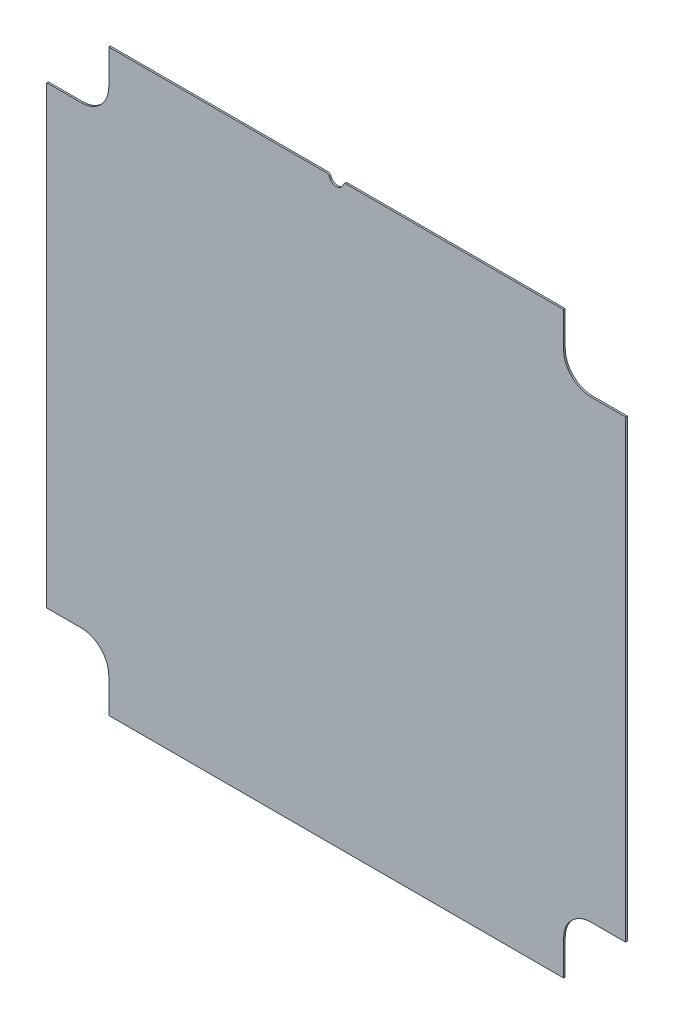
ISO-10303-21;
HEADER;
FILE_DESCRIPTION(('STEP AP214'),'2;1');
FILE_NAME('part.step','',(''),(''),'','','');
FILE_SCHEMA(('AUTOMOTIVE_DESIGN { 1 0 10303 214 1 1 1 1 }'));
ENDSEC;
DATA;
#1=APPLICATION_CONTEXT('core data for automotive mechanical design processes');
#2=APPLICATION_PROTOCOL_DEFINITION('international standard','automotive_design',2000,#1);
#3=PRODUCT_CONTEXT('',#1,'mechanical');
#4=PRODUCT('Part','Part','',(#3));
#5=PRODUCT_RELATED_PRODUCT_CATEGORY('part','',(#4));
#6=PRODUCT_DEFINITION_FORMATION('','',#4);
#7=PRODUCT_DEFINITION_CONTEXT('part definition',#1,'design');
#8=PRODUCT_DEFINITION('design','',#6,#7);
#9=PRODUCT_DEFINITION_SHAPE('','',#8);
#10=(LENGTH_UNIT() NAMED_UNIT(*) SI_UNIT(.MILLI.,.METRE.));
#11=(NAMED_UNIT(*) PLANE_ANGLE_UNIT() SI_UNIT($,.RADIAN.));
#12=(NAMED_UNIT(*) SI_UNIT($,.STERADIAN.) SOLID_ANGLE_UNIT());
#13=UNCERTAINTY_MEASURE_WITH_UNIT(LENGTH_MEASURE(1.E-05),#10,'distance_accuracy_value','');
#14=(GEOMETRIC_REPRESENTATION_CONTEXT(3) GLOBAL_UNCERTAINTY_ASSIGNED_CONTEXT((#13)) GLOBAL_UNIT_ASSIGNED_CONTEXT((#10,
#11,#12)) REPRESENTATION_CONTEXT('',''));
#15=CARTESIAN_POINT('',(0.,0.,0.));
#16=DIRECTION('',(0.,0.,1.));
#17=DIRECTION('',(1.,0.,0.));
#18=AXIS2_PLACEMENT_3D('',#15,#16,#17);
#19=CARTESIAN_POINT('',(-133.35,133.35,6.35));
#20=DIRECTION('',(0.,-1.,0.));
#21=DIRECTION('',(0.,0.,-1.));
#22=AXIS2_PLACEMENT_3D('',#19,#20,#21);
#23=PLANE('',#22);
#24=DIRECTION('',(-1.,0.,0.));
#25=VECTOR('',#24,1.);
#26=CARTESIAN_POINT('',(-133.35,133.35,6.35));
#27=LINE('',#26,#25);
#28=CARTESIAN_POINT('',(104.775,133.35,6.35));
#29=VERTEX_POINT('',#28);
#30=CARTESIAN_POINT('',(4.6246139298324,133.35,6.35));
#31=VERTEX_POINT('',#30);
#32=EDGE_CURVE('E222',#29,#31,#27,.T.);
#33=ORIENTED_EDGE('',*,*,#32,.F.);
#34=DIRECTION('',(0.,0.,1.));
#35=VECTOR('',#34,1.);
#36=CARTESIAN_POINT('',(104.775,133.35,5.58799999999997));
#37=LINE('',#36,#35);
#38=CARTESIAN_POINT('',(104.775,133.35,5.58799999999997));
#39=VERTEX_POINT('',#38);
#40=EDGE_CURVE('E266',#39,#29,#37,.T.);
#41=ORIENTED_EDGE('',*,*,#40,.F.);
#42=DIRECTION('',(1.,0.,0.));
#43=VECTOR('',#42,1.);
#44=CARTESIAN_POINT('',(-133.35,133.35,5.588));
#45=LINE('',#44,#43);
#46=CARTESIAN_POINT('',(4.6246139298324,133.35,5.588));
#47=VERTEX_POINT('',#46);
#48=EDGE_CURVE('E206',#47,#39,#45,.T.);
#49=ORIENTED_EDGE('',*,*,#48,.F.);
#50=DIRECTION('',(0.,0.,1.));
#51=VECTOR('',#50,1.);
#52=CARTESIAN_POINT('',(4.6246139298324,133.35,6.35));
#53=LINE('',#52,#51);
#54=EDGE_CURVE('E228',#47,#31,#53,.T.);
#55=ORIENTED_EDGE('',*,*,#54,.T.);
#56=EDGE_LOOP('',(#33,#41,#49,#55));
#57=FACE_BOUND('',#56,.T.);
#58=ADVANCED_FACE('F39',(#57),#23,.F.);
#59=CARTESIAN_POINT('',(0.,0.,6.35));
#60=DIRECTION('',(0.,0.,-1.));
#61=DIRECTION('',(-1.,0.,0.));
#62=AXIS2_PLACEMENT_3D('',#59,#60,#61);
#63=PLANE('',#62);
#64=DIRECTION('',(0.,1.,0.));
#65=VECTOR('',#64,1.);
#66=CARTESIAN_POINT('',(133.35,-133.35,6.35));
#67=LINE('',#66,#65);
#68=CARTESIAN_POINT('',(133.35,-104.775,6.35));
#69=VERTEX_POINT('',#68);
#70=CARTESIAN_POINT('',(133.35,104.775,6.35));
#71=VERTEX_POINT('',#70);
#72=EDGE_CURVE('E218',#69,#71,#67,.T.);
#73=ORIENTED_EDGE('',*,*,#72,.T.);
#74=DIRECTION('',(1.,0.,0.));
#75=VECTOR('',#74,1.);
#76=CARTESIAN_POINT('',(133.35,104.775,6.35));
#77=LINE('',#76,#75);
#78=CARTESIAN_POINT('',(117.475,104.775,6.35));
#79=VERTEX_POINT('',#78);
#80=EDGE_CURVE('E335',#79,#71,#77,.T.);
#81=ORIENTED_EDGE('',*,*,#80,.F.);
#82=CARTESIAN_POINT('',(117.475,117.475,6.35));
#83=DIRECTION('',(0.,0.,1.));
#84=DIRECTION('',(-1.,0.,0.));
#85=AXIS2_PLACEMENT_3D('',#82,#83,#84);
#86=CIRCLE('',#85,12.7);
#87=CARTESIAN_POINT('',(104.775,117.475,6.35));
#88=VERTEX_POINT('',#87);
#89=EDGE_CURVE('E339',#88,#79,#86,.T.);
#90=ORIENTED_EDGE('',*,*,#89,.F.);
#91=DIRECTION('',(0.,-1.,0.));
#92=VECTOR('',#91,1.);
#93=CARTESIAN_POINT('',(104.775,117.475,6.35));
#94=LINE('',#93,#92);
#95=EDGE_CURVE('E337',#29,#88,#94,.T.);
#96=ORIENTED_EDGE('',*,*,#95,.F.);
#97=ORIENTED_EDGE('',*,*,#32,.T.);
#98=CARTESIAN_POINT('',(4.62461392983241,131.7625,6.35));
#99=DIRECTION('',(0.,0.,-1.));
#100=DIRECTION('',(-1.,0.,0.));
#101=AXIS2_PLACEMENT_3D('',#98,#99,#100);
#102=CIRCLE('',#101,1.5875);
#103=CARTESIAN_POINT('',(3.12311590066604,132.277922077922,6.35));
#104=VERTEX_POINT('',#103);
#105=EDGE_CURVE('E233',#31,#104,#102,.F.);
#106=ORIENTED_EDGE('',*,*,#105,.T.);
#107=CARTESIAN_POINT('',(0.,133.35,6.35));
#108=DIRECTION('',(0.,0.,1.));
#109=DIRECTION('',(1.,0.,0.));
#110=AXIS2_PLACEMENT_3D('',#107,#108,#109);
#111=CIRCLE('',#110,3.302);
#112=CARTESIAN_POINT('',(-3.12311590066604,132.277922077922,6.35));
#113=VERTEX_POINT('',#112);
#114=EDGE_CURVE('E215',#113,#104,#111,.T.);
#115=ORIENTED_EDGE('',*,*,#114,.F.);
#116=CARTESIAN_POINT('',(-4.62461392983241,131.7625,6.35));
#117=DIRECTION('',(0.,0.,-1.));
#118=DIRECTION('',(-1.,0.,0.));
#119=AXIS2_PLACEMENT_3D('',#116,#117,#118);
#120=CIRCLE('',#119,1.5875);
#121=CARTESIAN_POINT('',(-4.6246139298324,133.35,6.35));
#122=VERTEX_POINT('',#121);
#123=EDGE_CURVE('E231',#113,#122,#120,.F.);
#124=ORIENTED_EDGE('',*,*,#123,.T.);
#125=CARTESIAN_POINT('',(-104.775,133.35,6.35));
#126=VERTEX_POINT('',#125);
#127=EDGE_CURVE('E221',#122,#126,#27,.T.);
#128=ORIENTED_EDGE('',*,*,#127,.T.);
#129=DIRECTION('',(0.,1.,0.));
#130=VECTOR('',#129,1.);
#131=CARTESIAN_POINT('',(-104.775,117.475,6.35));
#132=LINE('',#131,#130);
#133=CARTESIAN_POINT('',(-104.775,117.475,6.35));
#134=VERTEX_POINT('',#133);
#135=EDGE_CURVE('E283',#134,#126,#132,.T.);
#136=ORIENTED_EDGE('',*,*,#135,.F.);
#137=CARTESIAN_POINT('',(-117.475,117.475,6.35));
#138=DIRECTION('',(0.,0.,1.));
#139=DIRECTION('',(1.,0.,0.));
#140=AXIS2_PLACEMENT_3D('',#137,#138,#139);
#141=CIRCLE('',#140,12.7);
#142=CARTESIAN_POINT('',(-117.475,104.775,6.35));
#143=VERTEX_POINT('',#142);
#144=EDGE_CURVE('E292',#143,#134,#141,.T.);
#145=ORIENTED_EDGE('',*,*,#144,.F.);
#146=DIRECTION('',(1.,0.,0.));
#147=VECTOR('',#146,1.);
#148=CARTESIAN_POINT('',(-133.35,104.775,6.35));
#149=LINE('',#148,#147);
#150=CARTESIAN_POINT('',(-133.35,104.775,6.35));
#151=VERTEX_POINT('',#150);
#152=EDGE_CURVE('E289',#151,#143,#149,.T.);
#153=ORIENTED_EDGE('',*,*,#152,.F.);
#154=DIRECTION('',(0.,-1.,0.));
#155=VECTOR('',#154,1.);
#156=CARTESIAN_POINT('',(-133.35,-133.35,6.35));
#157=LINE('',#156,#155);
#158=CARTESIAN_POINT('',(-133.35,-104.775,6.35));
#159=VERTEX_POINT('',#158);
#160=EDGE_CURVE('E224',#151,#159,#157,.T.);
#161=ORIENTED_EDGE('',*,*,#160,.T.);
#162=DIRECTION('',(-1.,0.,0.));
#163=VECTOR('',#162,1.);
#164=CARTESIAN_POINT('',(-133.35,-104.775,6.35));
#165=LINE('',#164,#163);
#166=CARTESIAN_POINT('',(-117.475,-104.775,6.35));
#167=VERTEX_POINT('',#166);
#168=EDGE_CURVE('E183',#167,#159,#165,.T.);
#169=ORIENTED_EDGE('',*,*,#168,.F.);
#170=CARTESIAN_POINT('',(-117.475,-117.475,6.35));
#171=DIRECTION('',(0.,0.,1.));
#172=DIRECTION('',(-1.,0.,0.));
#173=AXIS2_PLACEMENT_3D('',#170,#171,#172);
#174=CIRCLE('',#173,12.7);
#175=CARTESIAN_POINT('',(-104.775,-117.475,6.35));
#176=VERTEX_POINT('',#175);
#177=EDGE_CURVE('E368',#176,#167,#174,.T.);
#178=ORIENTED_EDGE('',*,*,#177,.F.);
#179=DIRECTION('',(0.,1.,0.));
#180=VECTOR('',#179,1.);
#181=CARTESIAN_POINT('',(-104.775,-117.475,6.35));
#182=LINE('',#181,#180);
#183=CARTESIAN_POINT('',(-104.775,-133.35,6.35));
#184=VERTEX_POINT('',#183);
#185=EDGE_CURVE('E326',#184,#176,#182,.T.);
#186=ORIENTED_EDGE('',*,*,#185,.F.);
#187=DIRECTION('',(1.,0.,0.));
#188=VECTOR('',#187,1.);
#189=CARTESIAN_POINT('',(-133.35,-133.35,6.35));
#190=LINE('',#189,#188);
#191=CARTESIAN_POINT('',(104.775,-133.35,6.35));
#192=VERTEX_POINT('',#191);
#193=EDGE_CURVE('E192',#184,#192,#190,.T.);
#194=ORIENTED_EDGE('',*,*,#193,.T.);
#195=DIRECTION('',(0.,-1.,0.));
#196=VECTOR('',#195,1.);
#197=CARTESIAN_POINT('',(104.775,-117.475,6.35));
#198=LINE('',#197,#196);
#199=CARTESIAN_POINT('',(104.775,-117.475,6.35));
#200=VERTEX_POINT('',#199);
#201=EDGE_CURVE('E356',#200,#192,#198,.T.);
#202=ORIENTED_EDGE('',*,*,#201,.F.);
#203=CARTESIAN_POINT('',(117.475,-117.475,6.35));
#204=DIRECTION('',(0.,0.,1.));
#205=DIRECTION('',(1.,0.,0.));
#206=AXIS2_PLACEMENT_3D('',#203,#204,#205);
#207=CIRCLE('',#206,12.7);
#208=CARTESIAN_POINT('',(117.475,-104.775,6.35));
#209=VERTEX_POINT('',#208);
#210=EDGE_CURVE('E343',#209,#200,#207,.T.);
#211=ORIENTED_EDGE('',*,*,#210,.F.);
#212=DIRECTION('',(-1.,0.,0.));
#213=VECTOR('',#212,1.);
#214=CARTESIAN_POINT('',(133.35,-104.775,6.35));
#215=LINE('',#214,#213);
#216=EDGE_CURVE('E352',#69,#209,#215,.T.);
#217=ORIENTED_EDGE('',*,*,#216,.F.);
#218=EDGE_LOOP('',(#73,#81,#90,#96,#97,#106,#115,#124,#128,#136,#145,#153,#161,#169,#178,#186,
#194,#202,#211,#217));
#219=FACE_BOUND('',#218,.T.);
#220=ADVANCED_FACE('F350',(#219),#63,.F.);
#221=CARTESIAN_POINT('',(133.35,-133.35,6.35));
#222=DIRECTION('',(-1.,0.,0.));
#223=DIRECTION('',(0.,0.,1.));
#224=AXIS2_PLACEMENT_3D('',#221,#222,#223);
#225=PLANE('',#224);
#226=DIRECTION('',(0.,-1.,0.));
#227=VECTOR('',#226,1.);
#228=CARTESIAN_POINT('',(133.35,133.35,5.588));
#229=LINE('',#228,#227);
#230=CARTESIAN_POINT('',(133.35,104.775,5.58799999999997));
#231=VERTEX_POINT('',#230);
#232=CARTESIAN_POINT('',(133.35,-104.775,5.58799999999997));
#233=VERTEX_POINT('',#232);
#234=EDGE_CURVE('E209',#231,#233,#229,.T.);
#235=ORIENTED_EDGE('',*,*,#234,.F.);
#236=DIRECTION('',(0.,0.,1.));
#237=VECTOR('',#236,1.);
#238=CARTESIAN_POINT('',(133.35,104.775,5.58799999999997));
#239=LINE('',#238,#237);
#240=EDGE_CURVE('E318',#231,#71,#239,.T.);
#241=ORIENTED_EDGE('',*,*,#240,.T.);
#242=ORIENTED_EDGE('',*,*,#72,.F.);
#243=DIRECTION('',(0.,0.,1.));
#244=VECTOR('',#243,1.);
#245=CARTESIAN_POINT('',(133.35,-104.775,5.58799999999997));
#246=LINE('',#245,#244);
#247=EDGE_CURVE('E319',#233,#69,#246,.T.);
#248=ORIENTED_EDGE('',*,*,#247,.F.);
#249=EDGE_LOOP('',(#235,#241,#242,#248));
#250=FACE_BOUND('',#249,.T.);
#251=ADVANCED_FACE('F316',(#250),#225,.F.);
#252=CARTESIAN_POINT('',(-104.775,133.35,5.58799999999997));
#253=VERTEX_POINT('',#252);
#254=CARTESIAN_POINT('',(-4.6246139298324,133.35,5.588));
#255=VERTEX_POINT('',#254);
#256=EDGE_CURVE('E201',#253,#255,#45,.T.);
#257=ORIENTED_EDGE('',*,*,#256,.F.);
#258=DIRECTION('',(0.,0.,1.));
#259=VECTOR('',#258,1.);
#260=CARTESIAN_POINT('',(-104.775,133.35,5.58799999999997));
#261=LINE('',#260,#259);
#262=EDGE_CURVE('E297',#253,#126,#261,.T.);
#263=ORIENTED_EDGE('',*,*,#262,.T.);
#264=ORIENTED_EDGE('',*,*,#127,.F.);
#265=DIRECTION('',(0.,0.,1.));
#266=VECTOR('',#265,1.);
#267=CARTESIAN_POINT('',(-4.6246139298324,133.35,6.35));
#268=LINE('',#267,#266);
#269=EDGE_CURVE('E47',#122,#255,#268,.F.);
#270=ORIENTED_EDGE('',*,*,#269,.T.);
#271=EDGE_LOOP('',(#257,#263,#264,#270));
#272=FACE_BOUND('',#271,.T.);
#273=ADVANCED_FACE('F244',(#272),#23,.F.);
#274=CARTESIAN_POINT('',(-133.35,-133.35,6.35));
#275=DIRECTION('',(1.,0.,0.));
#276=DIRECTION('',(0.,0.,-1.));
#277=AXIS2_PLACEMENT_3D('',#274,#275,#276);
#278=PLANE('',#277);
#279=DIRECTION('',(0.,-1.,0.));
#280=VECTOR('',#279,1.);
#281=CARTESIAN_POINT('',(-133.35,133.35,5.588));
#282=LINE('',#281,#280);
#283=CARTESIAN_POINT('',(-133.35,104.775,5.58799999999997));
#284=VERTEX_POINT('',#283);
#285=CARTESIAN_POINT('',(-133.35,-104.775,5.58799999999997));
#286=VERTEX_POINT('',#285);
#287=EDGE_CURVE('E212',#284,#286,#282,.T.);
#288=ORIENTED_EDGE('',*,*,#287,.T.);
#289=DIRECTION('',(0.,0.,1.));
#290=VECTOR('',#289,1.);
#291=CARTESIAN_POINT('',(-133.35,-104.775,5.58799999999997));
#292=LINE('',#291,#290);
#293=EDGE_CURVE('E293',#286,#159,#292,.T.);
#294=ORIENTED_EDGE('',*,*,#293,.T.);
#295=ORIENTED_EDGE('',*,*,#160,.F.);
#296=DIRECTION('',(0.,0.,1.));
#297=VECTOR('',#296,1.);
#298=CARTESIAN_POINT('',(-133.35,104.775,5.58799999999997));
#299=LINE('',#298,#297);
#300=EDGE_CURVE('E288',#284,#151,#299,.T.);
#301=ORIENTED_EDGE('',*,*,#300,.F.);
#302=EDGE_LOOP('',(#288,#294,#295,#301));
#303=FACE_BOUND('',#302,.T.);
#304=ADVANCED_FACE('F379',(#303),#278,.F.);
#305=CARTESIAN_POINT('',(-133.35,-133.35,6.35));
#306=DIRECTION('',(0.,1.,0.));
#307=DIRECTION('',(0.,0.,1.));
#308=AXIS2_PLACEMENT_3D('',#305,#306,#307);
#309=PLANE('',#308);
#310=DIRECTION('',(1.,0.,0.));
#311=VECTOR('',#310,1.);
#312=CARTESIAN_POINT('',(-133.35,-133.35,5.58799999999997));
#313=LINE('',#312,#311);
#314=CARTESIAN_POINT('',(-104.775,-133.35,5.58799999999997));
#315=VERTEX_POINT('',#314);
#316=CARTESIAN_POINT('',(104.775,-133.35,5.58799999999997));
#317=VERTEX_POINT('',#316);
#318=EDGE_CURVE('E190',#315,#317,#313,.T.);
#319=ORIENTED_EDGE('',*,*,#318,.T.);
#320=DIRECTION('',(0.,0.,1.));
#321=VECTOR('',#320,1.);
#322=CARTESIAN_POINT('',(104.775,-133.35,5.58799999999997));
#323=LINE('',#322,#321);
#324=EDGE_CURVE('E324',#317,#192,#323,.T.);
#325=ORIENTED_EDGE('',*,*,#324,.T.);
#326=ORIENTED_EDGE('',*,*,#193,.F.);
#327=DIRECTION('',(0.,0.,1.));
#328=VECTOR('',#327,1.);
#329=CARTESIAN_POINT('',(-104.775,-133.35,5.58799999999997));
#330=LINE('',#329,#328);
#331=EDGE_CURVE('E178',#315,#184,#330,.T.);
#332=ORIENTED_EDGE('',*,*,#331,.F.);
#333=EDGE_LOOP('',(#319,#325,#326,#332));
#334=FACE_BOUND('',#333,.T.);
#335=ADVANCED_FACE('F188',(#334),#309,.F.);
#336=CARTESIAN_POINT('',(0.,133.35,0.));
#337=DIRECTION('',(0.,0.,1.));
#338=DIRECTION('',(1.,0.,0.));
#339=AXIS2_PLACEMENT_3D('',#336,#337,#338);
#340=CYLINDRICAL_SURFACE('',#339,3.302);
#341=DIRECTION('',(0.,0.,1.));
#342=VECTOR('',#341,1.);
#343=CARTESIAN_POINT('',(3.12311590066605,132.277922077922,0.));
#344=LINE('',#343,#342);
#345=CARTESIAN_POINT('',(3.12311590066605,132.277922077922,5.588));
#346=VERTEX_POINT('',#345);
#347=EDGE_CURVE('E237',#104,#346,#344,.F.);
#348=ORIENTED_EDGE('',*,*,#347,.T.);
#349=CARTESIAN_POINT('',(0.,133.35,5.588));
#350=DIRECTION('',(0.,0.,1.));
#351=DIRECTION('',(0.,-1.,0.));
#352=AXIS2_PLACEMENT_3D('',#349,#350,#351);
#353=CIRCLE('',#352,3.302);
#354=CARTESIAN_POINT('',(-3.12311590066604,132.277922077922,5.588));
#355=VERTEX_POINT('',#354);
#356=EDGE_CURVE('E200',#346,#355,#353,.F.);
#357=ORIENTED_EDGE('',*,*,#356,.T.);
#358=DIRECTION('',(0.,0.,1.));
#359=VECTOR('',#358,1.);
#360=CARTESIAN_POINT('',(-3.12311590066605,132.277922077922,0.));
#361=LINE('',#360,#359);
#362=EDGE_CURVE('E235',#355,#113,#361,.T.);
#363=ORIENTED_EDGE('',*,*,#362,.T.);
#364=ORIENTED_EDGE('',*,*,#114,.T.);
#365=EDGE_LOOP('',(#348,#357,#363,#364));
#366=FACE_BOUND('',#365,.T.);
#367=ADVANCED_FACE('F254',(#366),#340,.F.);
#368=CARTESIAN_POINT('',(4.62461392983241,131.7625,0.));
#369=DIRECTION('',(0.,0.,1.));
#370=DIRECTION('',(1.,0.,0.));
#371=AXIS2_PLACEMENT_3D('',#368,#369,#370);
#372=CYLINDRICAL_SURFACE('',#371,1.5875);
#373=CARTESIAN_POINT('',(4.62461392983241,131.7625,5.588));
#374=DIRECTION('',(0.,0.,1.));
#375=DIRECTION('',(0.,-1.,0.));
#376=AXIS2_PLACEMENT_3D('',#373,#374,#375);
#377=CIRCLE('',#376,1.5875);
#378=EDGE_CURVE('E204',#346,#47,#377,.F.);
#379=ORIENTED_EDGE('',*,*,#378,.F.);
#380=ORIENTED_EDGE('',*,*,#347,.F.);
#381=ORIENTED_EDGE('',*,*,#105,.F.);
#382=ORIENTED_EDGE('',*,*,#54,.F.);
#383=EDGE_LOOP('',(#379,#380,#381,#382));
#384=FACE_BOUND('',#383,.T.);
#385=ADVANCED_FACE('F259',(#384),#372,.T.);
#386=CARTESIAN_POINT('',(-4.62461392983241,131.7625,0.));
#387=DIRECTION('',(0.,0.,1.));
#388=DIRECTION('',(1.,0.,0.));
#389=AXIS2_PLACEMENT_3D('',#386,#387,#388);
#390=CYLINDRICAL_SURFACE('',#389,1.5875);
#391=CARTESIAN_POINT('',(-4.62461392983241,131.7625,5.588));
#392=DIRECTION('',(0.,0.,1.));
#393=DIRECTION('',(0.,-1.,0.));
#394=AXIS2_PLACEMENT_3D('',#391,#392,#393);
#395=CIRCLE('',#394,1.5875);
#396=EDGE_CURVE('E11',#255,#355,#395,.F.);
#397=ORIENTED_EDGE('',*,*,#396,.F.);
#398=ORIENTED_EDGE('',*,*,#269,.F.);
#399=ORIENTED_EDGE('',*,*,#123,.F.);
#400=ORIENTED_EDGE('',*,*,#362,.F.);
#401=EDGE_LOOP('',(#397,#398,#399,#400));
#402=FACE_BOUND('',#401,.T.);
#403=ADVANCED_FACE('F41',(#402),#390,.T.);
#404=CARTESIAN_POINT('',(-133.35,133.35,5.588));
#405=DIRECTION('',(0.,0.,1.));
#406=DIRECTION('',(0.,-1.,0.));
#407=AXIS2_PLACEMENT_3D('',#404,#405,#406);
#408=PLANE('',#407);
#409=CARTESIAN_POINT('',(117.475,117.475,5.58799999999997));
#410=DIRECTION('',(0.,0.,1.));
#411=DIRECTION('',(-1.,0.,0.));
#412=AXIS2_PLACEMENT_3D('',#409,#410,#411);
#413=CIRCLE('',#412,12.7);
#414=CARTESIAN_POINT('',(104.775,117.475,5.588));
#415=VERTEX_POINT('',#414);
#416=CARTESIAN_POINT('',(117.475,104.775,5.58799999999997));
#417=VERTEX_POINT('',#416);
#418=EDGE_CURVE('E54',#415,#417,#413,.T.);
#419=ORIENTED_EDGE('',*,*,#418,.T.);
#420=DIRECTION('',(1.,0.,0.));
#421=VECTOR('',#420,1.);
#422=CARTESIAN_POINT('',(133.35,104.775,5.58799999999997));
#423=LINE('',#422,#421);
#424=EDGE_CURVE('E271',#417,#231,#423,.T.);
#425=ORIENTED_EDGE('',*,*,#424,.T.);
#426=ORIENTED_EDGE('',*,*,#234,.T.);
#427=DIRECTION('',(-1.,0.,0.));
#428=VECTOR('',#427,1.);
#429=CARTESIAN_POINT('',(133.35,-104.775,5.58799999999997));
#430=LINE('',#429,#428);
#431=CARTESIAN_POINT('',(117.475,-104.775,5.58799999999997));
#432=VERTEX_POINT('',#431);
#433=EDGE_CURVE('E311',#233,#432,#430,.T.);
#434=ORIENTED_EDGE('',*,*,#433,.T.);
#435=CARTESIAN_POINT('',(117.475,-117.475,5.58799999999997));
#436=DIRECTION('',(0.,0.,1.));
#437=DIRECTION('',(1.,0.,0.));
#438=AXIS2_PLACEMENT_3D('',#435,#436,#437);
#439=CIRCLE('',#438,12.7);
#440=CARTESIAN_POINT('',(104.775,-117.475,5.58799999999997));
#441=VERTEX_POINT('',#440);
#442=EDGE_CURVE('E355',#432,#441,#439,.T.);
#443=ORIENTED_EDGE('',*,*,#442,.T.);
#444=DIRECTION('',(0.,-1.,0.));
#445=VECTOR('',#444,1.);
#446=CARTESIAN_POINT('',(104.775,-117.475,5.58799999999997));
#447=LINE('',#446,#445);
#448=EDGE_CURVE('E199',#441,#317,#447,.T.);
#449=ORIENTED_EDGE('',*,*,#448,.T.);
#450=ORIENTED_EDGE('',*,*,#318,.F.);
#451=DIRECTION('',(0.,1.,0.));
#452=VECTOR('',#451,1.);
#453=CARTESIAN_POINT('',(-104.775,-117.475,5.58799999999997));
#454=LINE('',#453,#452);
#455=CARTESIAN_POINT('',(-104.775,-117.475,5.58799999999997));
#456=VERTEX_POINT('',#455);
#457=EDGE_CURVE('E174',#315,#456,#454,.T.);
#458=ORIENTED_EDGE('',*,*,#457,.T.);
#459=CARTESIAN_POINT('',(-117.475,-117.475,5.58799999999997));
#460=DIRECTION('',(0.,0.,1.));
#461=DIRECTION('',(-1.,0.,0.));
#462=AXIS2_PLACEMENT_3D('',#459,#460,#461);
#463=CIRCLE('',#462,12.7);
#464=CARTESIAN_POINT('',(-117.475,-104.775,5.58799999999997));
#465=VERTEX_POINT('',#464);
#466=EDGE_CURVE('E62',#456,#465,#463,.T.);
#467=ORIENTED_EDGE('',*,*,#466,.T.);
#468=DIRECTION('',(-1.,0.,0.));
#469=VECTOR('',#468,1.);
#470=CARTESIAN_POINT('',(-133.35,-104.775,5.58799999999997));
#471=LINE('',#470,#469);
#472=EDGE_CURVE('E193',#465,#286,#471,.T.);
#473=ORIENTED_EDGE('',*,*,#472,.T.);
#474=ORIENTED_EDGE('',*,*,#287,.F.);
#475=DIRECTION('',(1.,0.,0.));
#476=VECTOR('',#475,1.);
#477=CARTESIAN_POINT('',(-133.35,104.775,5.58799999999997));
#478=LINE('',#477,#476);
#479=CARTESIAN_POINT('',(-117.475,104.775,5.588));
#480=VERTEX_POINT('',#479);
#481=EDGE_CURVE('E279',#284,#480,#478,.T.);
#482=ORIENTED_EDGE('',*,*,#481,.T.);
#483=CARTESIAN_POINT('',(-117.475,117.475,5.58799999999997));
#484=DIRECTION('',(0.,0.,1.));
#485=DIRECTION('',(1.,0.,0.));
#486=AXIS2_PLACEMENT_3D('',#483,#484,#485);
#487=CIRCLE('',#486,12.7);
#488=CARTESIAN_POINT('',(-104.775,117.475,5.58799999999997));
#489=VERTEX_POINT('',#488);
#490=EDGE_CURVE('E282',#480,#489,#487,.T.);
#491=ORIENTED_EDGE('',*,*,#490,.T.);
#492=DIRECTION('',(0.,1.,0.));
#493=VECTOR('',#492,1.);
#494=CARTESIAN_POINT('',(-104.775,117.475,5.58799999999997));
#495=LINE('',#494,#493);
#496=EDGE_CURVE('E286',#489,#253,#495,.T.);
#497=ORIENTED_EDGE('',*,*,#496,.T.);
#498=ORIENTED_EDGE('',*,*,#256,.T.);
#499=ORIENTED_EDGE('',*,*,#396,.T.);
#500=ORIENTED_EDGE('',*,*,#356,.F.);
#501=ORIENTED_EDGE('',*,*,#378,.T.);
#502=ORIENTED_EDGE('',*,*,#48,.T.);
#503=DIRECTION('',(0.,-1.,0.));
#504=VECTOR('',#503,1.);
#505=CARTESIAN_POINT('',(104.775,117.475,5.58799999999997));
#506=LINE('',#505,#504);
#507=EDGE_CURVE('E333',#39,#415,#506,.T.);
#508=ORIENTED_EDGE('',*,*,#507,.T.);
#509=EDGE_LOOP('',(#419,#425,#426,#434,#443,#449,#450,#458,#467,#473,#474,#482,#491,#497,#498,
#499,#500,#501,#502,#508));
#510=FACE_BOUND('',#509,.T.);
#511=ADVANCED_FACE('F196',(#510),#408,.F.);
#512=CARTESIAN_POINT('',(-104.775,117.475,5.58799999999997));
#513=DIRECTION('',(1.,0.,0.));
#514=DIRECTION('',(0.,0.,-1.));
#515=AXIS2_PLACEMENT_3D('',#512,#513,#514);
#516=PLANE('',#515);
#517=ORIENTED_EDGE('',*,*,#135,.T.);
#518=ORIENTED_EDGE('',*,*,#262,.F.);
#519=ORIENTED_EDGE('',*,*,#496,.F.);
#520=DIRECTION('',(0.,0.,1.));
#521=VECTOR('',#520,1.);
#522=CARTESIAN_POINT('',(-104.775,117.475,5.58799999999997));
#523=LINE('',#522,#521);
#524=EDGE_CURVE('E299',#489,#134,#523,.T.);
#525=ORIENTED_EDGE('',*,*,#524,.T.);
#526=EDGE_LOOP('',(#517,#518,#519,#525));
#527=FACE_BOUND('',#526,.T.);
#528=ADVANCED_FACE('F391',(#527),#516,.F.);
#529=CARTESIAN_POINT('',(-117.475,117.475,5.58799999999997));
#530=DIRECTION('',(0.,0.,1.));
#531=DIRECTION('',(1.,0.,0.));
#532=AXIS2_PLACEMENT_3D('',#529,#530,#531);
#533=CYLINDRICAL_SURFACE('',#532,12.7);
#534=ORIENTED_EDGE('',*,*,#144,.T.);
#535=ORIENTED_EDGE('',*,*,#524,.F.);
#536=ORIENTED_EDGE('',*,*,#490,.F.);
#537=DIRECTION('',(0.,0.,1.));
#538=VECTOR('',#537,1.);
#539=CARTESIAN_POINT('',(-117.475,104.775,5.58799999999997));
#540=LINE('',#539,#538);
#541=EDGE_CURVE('E301',#480,#143,#540,.T.);
#542=ORIENTED_EDGE('',*,*,#541,.T.);
#543=EDGE_LOOP('',(#534,#535,#536,#542));
#544=FACE_BOUND('',#543,.T.);
#545=ADVANCED_FACE('F389',(#544),#533,.F.);
#546=CARTESIAN_POINT('',(-133.35,104.775,5.58799999999997));
#547=DIRECTION('',(0.,-1.,0.));
#548=DIRECTION('',(1.,0.,0.));
#549=AXIS2_PLACEMENT_3D('',#546,#547,#548);
#550=PLANE('',#549);
#551=ORIENTED_EDGE('',*,*,#152,.T.);
#552=ORIENTED_EDGE('',*,*,#541,.F.);
#553=ORIENTED_EDGE('',*,*,#481,.F.);
#554=ORIENTED_EDGE('',*,*,#300,.T.);
#555=EDGE_LOOP('',(#551,#552,#553,#554));
#556=FACE_BOUND('',#555,.T.);
#557=ADVANCED_FACE('F386',(#556),#550,.F.);
#558=CARTESIAN_POINT('',(-133.35,-104.775,5.58799999999997));
#559=DIRECTION('',(0.,1.,0.));
#560=DIRECTION('',(-1.,0.,0.));
#561=AXIS2_PLACEMENT_3D('',#558,#559,#560);
#562=PLANE('',#561);
#563=ORIENTED_EDGE('',*,*,#168,.T.);
#564=ORIENTED_EDGE('',*,*,#293,.F.);
#565=ORIENTED_EDGE('',*,*,#472,.F.);
#566=DIRECTION('',(0.,0.,1.));
#567=VECTOR('',#566,1.);
#568=CARTESIAN_POINT('',(-117.475,-104.775,5.58799999999997));
#569=LINE('',#568,#567);
#570=EDGE_CURVE('E364',#465,#167,#569,.T.);
#571=ORIENTED_EDGE('',*,*,#570,.T.);
#572=EDGE_LOOP('',(#563,#564,#565,#571));
#573=FACE_BOUND('',#572,.T.);
#574=ADVANCED_FACE('F376',(#573),#562,.F.);
#575=CARTESIAN_POINT('',(-117.475,-117.475,5.58799999999997));
#576=DIRECTION('',(0.,0.,1.));
#577=DIRECTION('',(1.,0.,0.));
#578=AXIS2_PLACEMENT_3D('',#575,#576,#577);
#579=CYLINDRICAL_SURFACE('',#578,12.7);
#580=ORIENTED_EDGE('',*,*,#177,.T.);
#581=ORIENTED_EDGE('',*,*,#570,.F.);
#582=ORIENTED_EDGE('',*,*,#466,.F.);
#583=DIRECTION('',(0.,0.,1.));
#584=VECTOR('',#583,1.);
#585=CARTESIAN_POINT('',(-104.775,-117.475,5.58799999999997));
#586=LINE('',#585,#584);
#587=EDGE_CURVE('E180',#456,#176,#586,.T.);
#588=ORIENTED_EDGE('',*,*,#587,.T.);
#589=EDGE_LOOP('',(#580,#581,#582,#588));
#590=FACE_BOUND('',#589,.T.);
#591=ADVANCED_FACE('F450',(#590),#579,.F.);
#592=CARTESIAN_POINT('',(-104.775,-117.475,5.58799999999997));
#593=DIRECTION('',(1.,0.,0.));
#594=DIRECTION('',(0.,0.,-1.));
#595=AXIS2_PLACEMENT_3D('',#592,#593,#594);
#596=PLANE('',#595);
#597=ORIENTED_EDGE('',*,*,#185,.T.);
#598=ORIENTED_EDGE('',*,*,#587,.F.);
#599=ORIENTED_EDGE('',*,*,#457,.F.);
#600=ORIENTED_EDGE('',*,*,#331,.T.);
#601=EDGE_LOOP('',(#597,#598,#599,#600));
#602=FACE_BOUND('',#601,.T.);
#603=ADVANCED_FACE('F177',(#602),#596,.F.);
#604=CARTESIAN_POINT('',(117.475,-117.475,5.58799999999997));
#605=DIRECTION('',(0.,0.,1.));
#606=DIRECTION('',(1.,0.,0.));
#607=AXIS2_PLACEMENT_3D('',#604,#605,#606);
#608=CYLINDRICAL_SURFACE('',#607,12.7);
#609=ORIENTED_EDGE('',*,*,#210,.T.);
#610=DIRECTION('',(0.,0.,1.));
#611=VECTOR('',#610,1.);
#612=CARTESIAN_POINT('',(104.775,-117.475,5.58799999999997));
#613=LINE('',#612,#611);
#614=EDGE_CURVE('E328',#441,#200,#613,.T.);
#615=ORIENTED_EDGE('',*,*,#614,.F.);
#616=ORIENTED_EDGE('',*,*,#442,.F.);
#617=DIRECTION('',(0.,0.,1.));
#618=VECTOR('',#617,1.);
#619=CARTESIAN_POINT('',(117.475,-104.775,5.58799999999997));
#620=LINE('',#619,#618);
#621=EDGE_CURVE('E323',#432,#209,#620,.T.);
#622=ORIENTED_EDGE('',*,*,#621,.T.);
#623=EDGE_LOOP('',(#609,#615,#616,#622));
#624=FACE_BOUND('',#623,.T.);
#625=ADVANCED_FACE('F463',(#624),#608,.F.);
#626=CARTESIAN_POINT('',(133.35,-104.775,5.58799999999997));
#627=DIRECTION('',(0.,1.,0.));
#628=DIRECTION('',(-1.,0.,0.));
#629=AXIS2_PLACEMENT_3D('',#626,#627,#628);
#630=PLANE('',#629);
#631=ORIENTED_EDGE('',*,*,#216,.T.);
#632=ORIENTED_EDGE('',*,*,#621,.F.);
#633=ORIENTED_EDGE('',*,*,#433,.F.);
#634=ORIENTED_EDGE('',*,*,#247,.T.);
#635=EDGE_LOOP('',(#631,#632,#633,#634));
#636=FACE_BOUND('',#635,.T.);
#637=ADVANCED_FACE('F470',(#636),#630,.F.);
#638=CARTESIAN_POINT('',(104.775,-117.475,5.58799999999997));
#639=DIRECTION('',(-1.,0.,0.));
#640=DIRECTION('',(0.,0.,1.));
#641=AXIS2_PLACEMENT_3D('',#638,#639,#640);
#642=PLANE('',#641);
#643=ORIENTED_EDGE('',*,*,#201,.T.);
#644=ORIENTED_EDGE('',*,*,#324,.F.);
#645=ORIENTED_EDGE('',*,*,#448,.F.);
#646=ORIENTED_EDGE('',*,*,#614,.T.);
#647=EDGE_LOOP('',(#643,#644,#645,#646));
#648=FACE_BOUND('',#647,.T.);
#649=ADVANCED_FACE('F478',(#648),#642,.F.);
#650=CARTESIAN_POINT('',(133.35,104.775,5.58799999999997));
#651=DIRECTION('',(0.,-1.,0.));
#652=DIRECTION('',(1.,0.,0.));
#653=AXIS2_PLACEMENT_3D('',#650,#651,#652);
#654=PLANE('',#653);
#655=ORIENTED_EDGE('',*,*,#80,.T.);
#656=ORIENTED_EDGE('',*,*,#240,.F.);
#657=ORIENTED_EDGE('',*,*,#424,.F.);
#658=DIRECTION('',(0.,0.,1.));
#659=VECTOR('',#658,1.);
#660=CARTESIAN_POINT('',(117.475,104.775,5.58799999999997));
#661=LINE('',#660,#659);
#662=EDGE_CURVE('E273',#417,#79,#661,.T.);
#663=ORIENTED_EDGE('',*,*,#662,.T.);
#664=EDGE_LOOP('',(#655,#656,#657,#663));
#665=FACE_BOUND('',#664,.T.);
#666=ADVANCED_FACE('F345',(#665),#654,.F.);
#667=CARTESIAN_POINT('',(117.475,117.475,5.58799999999997));
#668=DIRECTION('',(0.,0.,1.));
#669=DIRECTION('',(1.,0.,0.));
#670=AXIS2_PLACEMENT_3D('',#667,#668,#669);
#671=CYLINDRICAL_SURFACE('',#670,12.7);
#672=ORIENTED_EDGE('',*,*,#89,.T.);
#673=ORIENTED_EDGE('',*,*,#662,.F.);
#674=ORIENTED_EDGE('',*,*,#418,.F.);
#675=DIRECTION('',(0.,0.,1.));
#676=VECTOR('',#675,1.);
#677=CARTESIAN_POINT('',(104.775,117.475,5.58799999999997));
#678=LINE('',#677,#676);
#679=EDGE_CURVE('E270',#415,#88,#678,.T.);
#680=ORIENTED_EDGE('',*,*,#679,.T.);
#681=EDGE_LOOP('',(#672,#673,#674,#680));
#682=FACE_BOUND('',#681,.T.);
#683=ADVANCED_FACE('F348',(#682),#671,.F.);
#684=CARTESIAN_POINT('',(104.775,117.475,5.58799999999997));
#685=DIRECTION('',(-1.,0.,0.));
#686=DIRECTION('',(0.,0.,1.));
#687=AXIS2_PLACEMENT_3D('',#684,#685,#686);
#688=PLANE('',#687);
#689=ORIENTED_EDGE('',*,*,#95,.T.);
#690=ORIENTED_EDGE('',*,*,#679,.F.);
#691=ORIENTED_EDGE('',*,*,#507,.F.);
#692=ORIENTED_EDGE('',*,*,#40,.T.);
#693=EDGE_LOOP('',(#689,#690,#691,#692));
#694=FACE_BOUND('',#693,.T.);
#695=ADVANCED_FACE('F392',(#694),#688,.F.);
#696=CLOSED_SHELL('',(#58,#220,#251,#273,#304,#335,#367,#385,#403,#511,#528,#545,#557,#574,#591,
#603,#625,#637,#649,#666,#683,#695));
#697=MANIFOLD_SOLID_BREP('B2',#696);
#698=ADVANCED_BREP_SHAPE_REPRESENTATION('',(#18,#697),#14);
#699=SHAPE_DEFINITION_REPRESENTATION(#9,#698);
ENDSEC;
END-ISO-10303-21;
